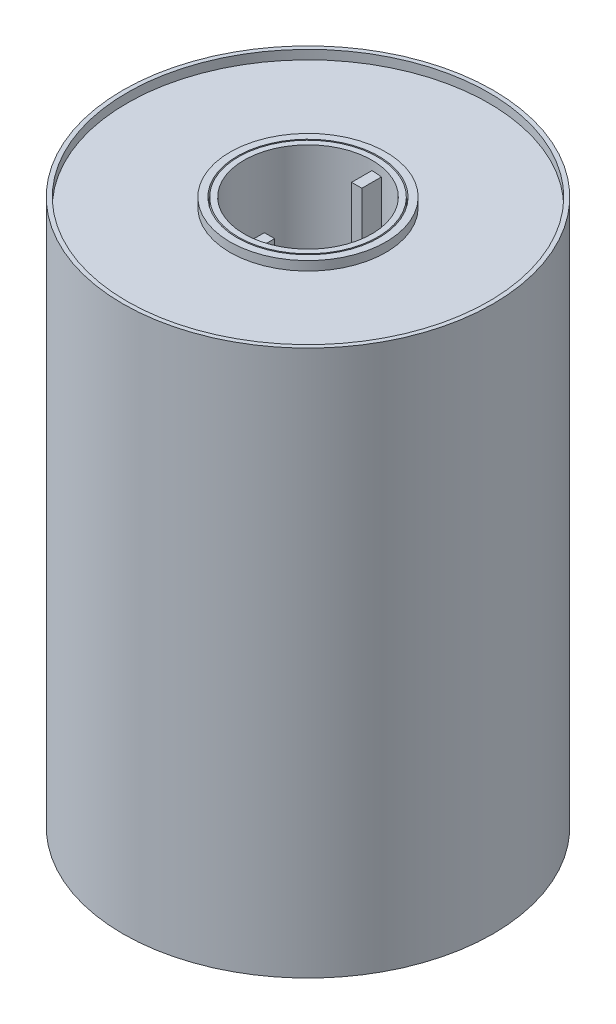
ISO-10303-21;
HEADER;
FILE_DESCRIPTION(('STEP AP214'),'2;1');
FILE_NAME('part.step','',(''),(''),'','','');
FILE_SCHEMA(('AUTOMOTIVE_DESIGN { 1 0 10303 214 1 1 1 1 }'));
ENDSEC;
DATA;
#1=APPLICATION_CONTEXT('core data for automotive mechanical design processes');
#2=APPLICATION_PROTOCOL_DEFINITION('international standard','automotive_design',2000,#1);
#3=PRODUCT_CONTEXT('',#1,'mechanical');
#4=PRODUCT('Part','Part','',(#3));
#5=PRODUCT_RELATED_PRODUCT_CATEGORY('part','',(#4));
#6=PRODUCT_DEFINITION_FORMATION('','',#4);
#7=PRODUCT_DEFINITION_CONTEXT('part definition',#1,'design');
#8=PRODUCT_DEFINITION('design','',#6,#7);
#9=PRODUCT_DEFINITION_SHAPE('','',#8);
#10=(LENGTH_UNIT() NAMED_UNIT(*) SI_UNIT(.MILLI.,.METRE.));
#11=(NAMED_UNIT(*) PLANE_ANGLE_UNIT() SI_UNIT($,.RADIAN.));
#12=(NAMED_UNIT(*) SI_UNIT($,.STERADIAN.) SOLID_ANGLE_UNIT());
#13=UNCERTAINTY_MEASURE_WITH_UNIT(LENGTH_MEASURE(1.E-05),#10,'distance_accuracy_value','');
#14=(GEOMETRIC_REPRESENTATION_CONTEXT(3) GLOBAL_UNCERTAINTY_ASSIGNED_CONTEXT((#13)) GLOBAL_UNIT_ASSIGNED_CONTEXT((#10,
#11,#12)) REPRESENTATION_CONTEXT('',''));
#15=CARTESIAN_POINT('',(0.,0.,0.));
#16=DIRECTION('',(0.,0.,1.));
#17=DIRECTION('',(1.,0.,0.));
#18=AXIS2_PLACEMENT_3D('',#15,#16,#17);
#19=CARTESIAN_POINT('',(0.,147.5,0.));
#20=DIRECTION('',(0.,1.,0.));
#21=DIRECTION('',(0.,0.,1.));
#22=AXIS2_PLACEMENT_3D('',#19,#20,#21);
#23=PLANE('',#22);
#24=CARTESIAN_POINT('',(0.,147.5,0.));
#25=DIRECTION('',(0.,1.,0.));
#26=DIRECTION('',(0.,0.,1.));
#27=AXIS2_PLACEMENT_3D('',#24,#25,#26);
#28=CIRCLE('',#27,19.1218292024238);
#29=CARTESIAN_POINT('',(0.,147.5,19.1218292024238));
#30=VERTEX_POINT('',#29);
#31=EDGE_CURVE('E179',#30,#30,#28,.T.);
#32=ORIENTED_EDGE('',*,*,#31,.F.);
#33=EDGE_LOOP('',(#32));
#34=FACE_BOUND('',#33,.T.);
#35=CARTESIAN_POINT('',(0.,147.5,0.));
#36=DIRECTION('',(0.,1.,0.));
#37=DIRECTION('',(0.,0.,1.));
#38=AXIS2_PLACEMENT_3D('',#35,#36,#37);
#39=CIRCLE('',#38,19.4629871836898);
#40=CARTESIAN_POINT('',(0.,147.5,19.4629871836898));
#41=VERTEX_POINT('',#40);
#42=EDGE_CURVE('E11',#41,#41,#39,.F.);
#43=ORIENTED_EDGE('',*,*,#42,.F.);
#44=EDGE_LOOP('',(#43));
#45=FACE_BOUND('',#44,.T.);
#46=ADVANCED_FACE('F37',(#34,#45),#23,.T.);
#47=CARTESIAN_POINT('',(0.,0.,0.));
#48=DIRECTION('',(0.,1.,0.));
#49=DIRECTION('',(0.,0.,1.));
#50=AXIS2_PLACEMENT_3D('',#47,#48,#49);
#51=CYLINDRICAL_SURFACE('',#50,17.5714106184439);
#52=DIRECTION('',(0.,1.,0.));
#53=VECTOR('',#52,1.);
#54=CARTESIAN_POINT('',(0.,2.5,17.5714106184439));
#55=LINE('',#54,#53);
#56=CARTESIAN_POINT('',(0.,2.5,17.5714106184439));
#57=VERTEX_POINT('',#56);
#58=CARTESIAN_POINT('',(0.,147.5,17.5714106184439));
#59=VERTEX_POINT('',#58);
#60=EDGE_CURVE('E56',#57,#59,#55,.T.);
#61=ORIENTED_EDGE('',*,*,#60,.F.);
#62=CARTESIAN_POINT('',(0.,2.5,0.));
#63=DIRECTION('',(0.,-1.,0.));
#64=DIRECTION('',(0.,0.,-1.));
#65=AXIS2_PLACEMENT_3D('',#62,#63,#64);
#66=CIRCLE('',#65,17.5714106184439);
#67=CARTESIAN_POINT('',(2.81398906962431,2.5,17.344622700941));
#68=VERTEX_POINT('',#67);
#69=EDGE_CURVE('E45',#57,#68,#66,.F.);
#70=ORIENTED_EDGE('',*,*,#69,.T.);
#71=DIRECTION('',(0.,1.,0.));
#72=VECTOR('',#71,1.);
#73=CARTESIAN_POINT('',(2.81398906962431,0.,17.344622700941));
#74=LINE('',#73,#72);
#75=CARTESIAN_POINT('',(2.81398906962431,147.5,17.344622700941));
#76=VERTEX_POINT('',#75);
#77=EDGE_CURVE('E105',#68,#76,#74,.T.);
#78=ORIENTED_EDGE('',*,*,#77,.T.);
#79=CARTESIAN_POINT('',(0.,147.5,0.));
#80=DIRECTION('',(0.,-1.,0.));
#81=DIRECTION('',(0.,0.,-1.));
#82=AXIS2_PLACEMENT_3D('',#79,#80,#81);
#83=CIRCLE('',#82,17.5714106184439);
#84=EDGE_CURVE('E213',#59,#76,#83,.F.);
#85=ORIENTED_EDGE('',*,*,#84,.F.);
#86=EDGE_LOOP('',(#61,#70,#78,#85));
#87=FACE_BOUND('',#86,.T.);
#88=CARTESIAN_POINT('',(0.,150.,0.));
#89=DIRECTION('',(0.,1.,0.));
#90=DIRECTION('',(0.,0.,1.));
#91=AXIS2_PLACEMENT_3D('',#88,#89,#90);
#92=CIRCLE('',#91,17.5714106184439);
#93=CARTESIAN_POINT('',(0.,150.,17.5714106184439));
#94=VERTEX_POINT('',#93);
#95=EDGE_CURVE('E188',#94,#94,#92,.T.);
#96=ORIENTED_EDGE('',*,*,#95,.T.);
#97=EDGE_LOOP('',(#96));
#98=FACE_BOUND('',#97,.T.);
#99=CARTESIAN_POINT('',(0.,0.,0.));
#100=DIRECTION('',(0.,1.,0.));
#101=DIRECTION('',(0.,0.,1.));
#102=AXIS2_PLACEMENT_3D('',#99,#100,#101);
#103=CIRCLE('',#102,17.5714106184439);
#104=CARTESIAN_POINT('',(0.,0.,17.5714106184439));
#105=VERTEX_POINT('',#104);
#106=EDGE_CURVE('E191',#105,#105,#103,.T.);
#107=ORIENTED_EDGE('',*,*,#106,.F.);
#108=EDGE_LOOP('',(#107));
#109=FACE_BOUND('',#108,.T.);
#110=CARTESIAN_POINT('',(0.,2.5,0.));
#111=DIRECTION('',(0.,1.,0.));
#112=DIRECTION('',(0.,0.,1.));
#113=AXIS2_PLACEMENT_3D('',#110,#111,#112);
#114=CIRCLE('',#113,17.5714106184439);
#115=CARTESIAN_POINT('',(0.,2.5,-17.5714106184439));
#116=VERTEX_POINT('',#115);
#117=CARTESIAN_POINT('',(2.81398906962431,2.5,-17.344622700941));
#118=VERTEX_POINT('',#117);
#119=EDGE_CURVE('E211',#116,#118,#114,.F.);
#120=ORIENTED_EDGE('',*,*,#119,.F.);
#121=DIRECTION('',(0.,1.,0.));
#122=VECTOR('',#121,1.);
#123=CARTESIAN_POINT('',(0.,2.5,-17.5714106184439));
#124=LINE('',#123,#122);
#125=CARTESIAN_POINT('',(0.,147.5,-17.5714106184439));
#126=VERTEX_POINT('',#125);
#127=EDGE_CURVE('E151',#116,#126,#124,.T.);
#128=ORIENTED_EDGE('',*,*,#127,.T.);
#129=CARTESIAN_POINT('',(0.,147.5,0.));
#130=DIRECTION('',(0.,1.,0.));
#131=DIRECTION('',(0.,0.,1.));
#132=AXIS2_PLACEMENT_3D('',#129,#130,#131);
#133=CIRCLE('',#132,17.5714106184439);
#134=CARTESIAN_POINT('',(2.81398906962431,147.5,-17.344622700941));
#135=VERTEX_POINT('',#134);
#136=EDGE_CURVE('E205',#126,#135,#133,.F.);
#137=ORIENTED_EDGE('',*,*,#136,.T.);
#138=DIRECTION('',(0.,1.,0.));
#139=VECTOR('',#138,1.);
#140=CARTESIAN_POINT('',(2.81398906962431,0.,-17.344622700941));
#141=LINE('',#140,#139);
#142=EDGE_CURVE('E208',#135,#118,#141,.F.);
#143=ORIENTED_EDGE('',*,*,#142,.T.);
#144=EDGE_LOOP('',(#120,#128,#137,#143));
#145=FACE_BOUND('',#144,.T.);
#146=ADVANCED_FACE('F216',(#87,#98,#109,#145),#51,.F.);
#147=CARTESIAN_POINT('',(0.,0.,0.));
#148=DIRECTION('',(0.,1.,0.));
#149=DIRECTION('',(0.,0.,1.));
#150=AXIS2_PLACEMENT_3D('',#147,#148,#149);
#151=PLANE('',#150);
#152=CARTESIAN_POINT('',(0.,0.,0.));
#153=DIRECTION('',(0.,1.,0.));
#154=DIRECTION('',(0.,0.,1.));
#155=AXIS2_PLACEMENT_3D('',#152,#153,#154);
#156=CIRCLE('',#155,19.4768924120961);
#157=CARTESIAN_POINT('',(0.,0.,19.4768924120961));
#158=VERTEX_POINT('',#157);
#159=EDGE_CURVE('E200',#158,#158,#156,.F.);
#160=ORIENTED_EDGE('',*,*,#159,.F.);
#161=EDGE_LOOP('',(#160));
#162=FACE_BOUND('',#161,.T.);
#163=CARTESIAN_POINT('',(0.,0.,0.));
#164=DIRECTION('',(0.,-1.,0.));
#165=DIRECTION('',(0.,0.,-1.));
#166=AXIS2_PLACEMENT_3D('',#163,#164,#165);
#167=CIRCLE('',#166,21.5317394756691);
#168=CARTESIAN_POINT('',(0.,0.,-21.5317394756691));
#169=VERTEX_POINT('',#168);
#170=EDGE_CURVE('E154',#169,#169,#167,.T.);
#171=ORIENTED_EDGE('',*,*,#170,.T.);
#172=EDGE_LOOP('',(#171));
#173=FACE_BOUND('',#172,.T.);
#174=ADVANCED_FACE('F256',(#162,#173),#151,.F.);
#175=ORIENTED_EDGE('',*,*,#106,.T.);
#176=EDGE_LOOP('',(#175));
#177=FACE_BOUND('',#176,.T.);
#178=CARTESIAN_POINT('',(0.,0.,0.));
#179=DIRECTION('',(0.,-1.,0.));
#180=DIRECTION('',(0.,0.,-1.));
#181=AXIS2_PLACEMENT_3D('',#178,#179,#180);
#182=CIRCLE('',#181,17.829813715774);
#183=CARTESIAN_POINT('',(0.,0.,-17.829813715774));
#184=VERTEX_POINT('',#183);
#185=EDGE_CURVE('E167',#184,#184,#182,.T.);
#186=ORIENTED_EDGE('',*,*,#185,.T.);
#187=EDGE_LOOP('',(#186));
#188=FACE_BOUND('',#187,.T.);
#189=ADVANCED_FACE('F293',(#177,#188),#151,.F.);
#190=CARTESIAN_POINT('',(0.,150.,0.));
#191=DIRECTION('',(0.,1.,0.));
#192=DIRECTION('',(0.,0.,1.));
#193=AXIS2_PLACEMENT_3D('',#190,#191,#192);
#194=PLANE('',#193);
#195=ORIENTED_EDGE('',*,*,#95,.F.);
#196=EDGE_LOOP('',(#195));
#197=FACE_BOUND('',#196,.T.);
#198=CARTESIAN_POINT('',(0.,150.,0.));
#199=DIRECTION('',(0.,1.,0.));
#200=DIRECTION('',(0.,0.,1.));
#201=AXIS2_PLACEMENT_3D('',#198,#199,#200);
#202=CIRCLE('',#201,19.1218292024238);
#203=CARTESIAN_POINT('',(0.,150.,19.1218292024238));
#204=VERTEX_POINT('',#203);
#205=EDGE_CURVE('E178',#204,#204,#202,.T.);
#206=ORIENTED_EDGE('',*,*,#205,.T.);
#207=EDGE_LOOP('',(#206));
#208=FACE_BOUND('',#207,.T.);
#209=ADVANCED_FACE('F284',(#197,#208),#194,.T.);
#210=CARTESIAN_POINT('',(0.,150.,0.));
#211=DIRECTION('',(0.,-1.,0.));
#212=DIRECTION('',(0.,0.,-1.));
#213=AXIS2_PLACEMENT_3D('',#210,#211,#212);
#214=CYLINDRICAL_SURFACE('',#213,50.8900947095449);
#215=CARTESIAN_POINT('',(0.,150.,0.));
#216=DIRECTION('',(0.,1.,0.));
#217=DIRECTION('',(0.,0.,1.));
#218=AXIS2_PLACEMENT_3D('',#215,#216,#217);
#219=CIRCLE('',#218,50.8900947095449);
#220=CARTESIAN_POINT('',(0.,150.,50.8900947095449));
#221=VERTEX_POINT('',#220);
#222=EDGE_CURVE('E197',#221,#221,#219,.T.);
#223=ORIENTED_EDGE('',*,*,#222,.F.);
#224=EDGE_LOOP('',(#223));
#225=FACE_BOUND('',#224,.T.);
#226=CARTESIAN_POINT('',(0.,0.,0.));
#227=DIRECTION('',(0.,1.,0.));
#228=DIRECTION('',(0.,0.,1.));
#229=AXIS2_PLACEMENT_3D('',#226,#227,#228);
#230=CIRCLE('',#229,50.8900947095449);
#231=CARTESIAN_POINT('',(0.,0.,50.8900947095449));
#232=VERTEX_POINT('',#231);
#233=EDGE_CURVE('E194',#232,#232,#230,.T.);
#234=ORIENTED_EDGE('',*,*,#233,.T.);
#235=EDGE_LOOP('',(#234));
#236=FACE_BOUND('',#235,.T.);
#237=ADVANCED_FACE('F39',(#225,#236),#214,.T.);
#238=CARTESIAN_POINT('',(0.,150.,0.));
#239=DIRECTION('',(0.,1.,0.));
#240=DIRECTION('',(0.,0.,1.));
#241=AXIS2_PLACEMENT_3D('',#238,#239,#240);
#242=CIRCLE('',#241,49.7184279972298);
#243=CARTESIAN_POINT('',(0.,150.,49.7184279972298));
#244=VERTEX_POINT('',#243);
#245=EDGE_CURVE('E182',#244,#244,#242,.T.);
#246=ORIENTED_EDGE('',*,*,#245,.F.);
#247=EDGE_LOOP('',(#246));
#248=FACE_BOUND('',#247,.T.);
#249=ORIENTED_EDGE('',*,*,#222,.T.);
#250=EDGE_LOOP('',(#249));
#251=FACE_BOUND('',#250,.T.);
#252=ADVANCED_FACE('F280',(#248,#251),#194,.T.);
#253=CARTESIAN_POINT('',(0.,0.,0.));
#254=DIRECTION('',(0.,-1.,0.));
#255=DIRECTION('',(0.,0.,-1.));
#256=AXIS2_PLACEMENT_3D('',#253,#254,#255);
#257=CIRCLE('',#256,49.233249933002);
#258=CARTESIAN_POINT('',(0.,0.,-49.233249933002));
#259=VERTEX_POINT('',#258);
#260=EDGE_CURVE('E161',#259,#259,#257,.T.);
#261=ORIENTED_EDGE('',*,*,#260,.F.);
#262=EDGE_LOOP('',(#261));
#263=FACE_BOUND('',#262,.T.);
#264=ORIENTED_EDGE('',*,*,#233,.F.);
#265=EDGE_LOOP('',(#264));
#266=FACE_BOUND('',#265,.T.);
#267=ADVANCED_FACE('F272',(#263,#266),#151,.F.);
#268=CARTESIAN_POINT('',(0.,147.5,0.));
#269=DIRECTION('',(0.,1.,0.));
#270=DIRECTION('',(0.,0.,1.));
#271=AXIS2_PLACEMENT_3D('',#268,#269,#270);
#272=CYLINDRICAL_SURFACE('',#271,49.7184279972298);
#273=CARTESIAN_POINT('',(0.,147.5,0.));
#274=DIRECTION('',(0.,1.,0.));
#275=DIRECTION('',(0.,0.,1.));
#276=AXIS2_PLACEMENT_3D('',#273,#274,#275);
#277=CIRCLE('',#276,49.7184279972298);
#278=CARTESIAN_POINT('',(0.,147.5,49.7184279972298));
#279=VERTEX_POINT('',#278);
#280=EDGE_CURVE('E185',#279,#279,#277,.T.);
#281=ORIENTED_EDGE('',*,*,#280,.F.);
#282=EDGE_LOOP('',(#281));
#283=FACE_BOUND('',#282,.T.);
#284=ORIENTED_EDGE('',*,*,#245,.T.);
#285=EDGE_LOOP('',(#284));
#286=FACE_BOUND('',#285,.T.);
#287=ADVANCED_FACE('F264',(#283,#286),#272,.F.);
#288=CARTESIAN_POINT('',(0.,147.5,0.));
#289=DIRECTION('',(0.,1.,0.));
#290=DIRECTION('',(0.,0.,1.));
#291=AXIS2_PLACEMENT_3D('',#288,#289,#290);
#292=CIRCLE('',#291,21.4211400149472);
#293=CARTESIAN_POINT('',(0.,147.5,21.4211400149472));
#294=VERTEX_POINT('',#293);
#295=EDGE_CURVE('E224',#294,#294,#292,.T.);
#296=ORIENTED_EDGE('',*,*,#295,.F.);
#297=EDGE_LOOP('',(#296));
#298=FACE_BOUND('',#297,.T.);
#299=ORIENTED_EDGE('',*,*,#280,.T.);
#300=EDGE_LOOP('',(#299));
#301=FACE_BOUND('',#300,.T.);
#302=ADVANCED_FACE('F252',(#298,#301),#23,.T.);
#303=CARTESIAN_POINT('',(0.,147.5,0.));
#304=DIRECTION('',(0.,1.,0.));
#305=DIRECTION('',(0.,0.,1.));
#306=AXIS2_PLACEMENT_3D('',#303,#304,#305);
#307=CYLINDRICAL_SURFACE('',#306,19.1218292024238);
#308=ORIENTED_EDGE('',*,*,#31,.T.);
#309=EDGE_LOOP('',(#308));
#310=FACE_BOUND('',#309,.T.);
#311=ORIENTED_EDGE('',*,*,#205,.F.);
#312=EDGE_LOOP('',(#311));
#313=FACE_BOUND('',#312,.T.);
#314=ADVANCED_FACE('F263',(#310,#313),#307,.T.);
#315=CARTESIAN_POINT('',(0.,-15.,0.));
#316=DIRECTION('',(0.,-1.,0.));
#317=DIRECTION('',(0.,0.,-1.));
#318=AXIS2_PLACEMENT_3D('',#315,#316,#317);
#319=PLANE('',#318);
#320=CARTESIAN_POINT('',(0.,-15.,0.));
#321=DIRECTION('',(0.,-1.,0.));
#322=DIRECTION('',(0.,0.,-1.));
#323=AXIS2_PLACEMENT_3D('',#320,#321,#322);
#324=CIRCLE('',#323,19.4768924120961);
#325=CARTESIAN_POINT('',(0.,-15.,-19.4768924120961));
#326=VERTEX_POINT('',#325);
#327=EDGE_CURVE('E173',#326,#326,#324,.T.);
#328=ORIENTED_EDGE('',*,*,#327,.T.);
#329=EDGE_LOOP('',(#328));
#330=FACE_BOUND('',#329,.T.);
#331=CARTESIAN_POINT('',(0.,-15.,0.));
#332=DIRECTION('',(0.,-1.,0.));
#333=DIRECTION('',(0.,0.,-1.));
#334=AXIS2_PLACEMENT_3D('',#331,#332,#333);
#335=CIRCLE('',#334,17.829813715774);
#336=CARTESIAN_POINT('',(0.,-15.,-17.829813715774));
#337=VERTEX_POINT('',#336);
#338=EDGE_CURVE('E170',#337,#337,#335,.T.);
#339=ORIENTED_EDGE('',*,*,#338,.F.);
#340=EDGE_LOOP('',(#339));
#341=FACE_BOUND('',#340,.T.);
#342=ADVANCED_FACE('F270',(#330,#341),#319,.T.);
#343=CARTESIAN_POINT('',(0.,-15.,0.));
#344=DIRECTION('',(0.,1.,0.));
#345=DIRECTION('',(0.,0.,1.));
#346=AXIS2_PLACEMENT_3D('',#343,#344,#345);
#347=CYLINDRICAL_SURFACE('',#346,19.4768924120961);
#348=ORIENTED_EDGE('',*,*,#327,.F.);
#349=EDGE_LOOP('',(#348));
#350=FACE_BOUND('',#349,.T.);
#351=ORIENTED_EDGE('',*,*,#159,.T.);
#352=EDGE_LOOP('',(#351));
#353=FACE_BOUND('',#352,.T.);
#354=ADVANCED_FACE('F312',(#350,#353),#347,.T.);
#355=CARTESIAN_POINT('',(0.,-15.,0.));
#356=DIRECTION('',(0.,1.,0.));
#357=DIRECTION('',(0.,0.,1.));
#358=AXIS2_PLACEMENT_3D('',#355,#356,#357);
#359=CYLINDRICAL_SURFACE('',#358,17.829813715774);
#360=ORIENTED_EDGE('',*,*,#338,.T.);
#361=EDGE_LOOP('',(#360));
#362=FACE_BOUND('',#361,.T.);
#363=ORIENTED_EDGE('',*,*,#185,.F.);
#364=EDGE_LOOP('',(#363));
#365=FACE_BOUND('',#364,.T.);
#366=ADVANCED_FACE('F309',(#362,#365),#359,.F.);
#367=CARTESIAN_POINT('',(0.,5.,0.));
#368=DIRECTION('',(0.,-1.,0.));
#369=DIRECTION('',(0.,0.,-1.));
#370=AXIS2_PLACEMENT_3D('',#367,#368,#369);
#371=CYLINDRICAL_SURFACE('',#370,49.233249933002);
#372=CARTESIAN_POINT('',(0.,5.,0.));
#373=DIRECTION('',(0.,-1.,0.));
#374=DIRECTION('',(0.,0.,-1.));
#375=AXIS2_PLACEMENT_3D('',#372,#373,#374);
#376=CIRCLE('',#375,49.233249933002);
#377=CARTESIAN_POINT('',(0.,5.,-49.233249933002));
#378=VERTEX_POINT('',#377);
#379=EDGE_CURVE('E164',#378,#378,#376,.T.);
#380=ORIENTED_EDGE('',*,*,#379,.F.);
#381=EDGE_LOOP('',(#380));
#382=FACE_BOUND('',#381,.T.);
#383=ORIENTED_EDGE('',*,*,#260,.T.);
#384=EDGE_LOOP('',(#383));
#385=FACE_BOUND('',#384,.T.);
#386=ADVANCED_FACE('F311',(#382,#385),#371,.F.);
#387=CARTESIAN_POINT('',(0.,5.,0.));
#388=DIRECTION('',(0.,-1.,0.));
#389=DIRECTION('',(0.,0.,-1.));
#390=AXIS2_PLACEMENT_3D('',#387,#388,#389);
#391=PLANE('',#390);
#392=CARTESIAN_POINT('',(0.,5.,0.));
#393=DIRECTION('',(0.,-1.,0.));
#394=DIRECTION('',(0.,0.,-1.));
#395=AXIS2_PLACEMENT_3D('',#392,#393,#394);
#396=CIRCLE('',#395,21.5317394756691);
#397=CARTESIAN_POINT('',(0.,5.,-21.5317394756691));
#398=VERTEX_POINT('',#397);
#399=EDGE_CURVE('E158',#398,#398,#396,.T.);
#400=ORIENTED_EDGE('',*,*,#399,.F.);
#401=EDGE_LOOP('',(#400));
#402=FACE_BOUND('',#401,.T.);
#403=ORIENTED_EDGE('',*,*,#379,.T.);
#404=EDGE_LOOP('',(#403));
#405=FACE_BOUND('',#404,.T.);
#406=ADVANCED_FACE('F319',(#402,#405),#391,.T.);
#407=CARTESIAN_POINT('',(0.,5.,0.));
#408=DIRECTION('',(0.,-1.,0.));
#409=DIRECTION('',(0.,0.,-1.));
#410=AXIS2_PLACEMENT_3D('',#407,#408,#409);
#411=CYLINDRICAL_SURFACE('',#410,21.5317394756691);
#412=ORIENTED_EDGE('',*,*,#399,.T.);
#413=EDGE_LOOP('',(#412));
#414=FACE_BOUND('',#413,.T.);
#415=ORIENTED_EDGE('',*,*,#170,.F.);
#416=EDGE_LOOP('',(#415));
#417=FACE_BOUND('',#416,.T.);
#418=ADVANCED_FACE('F338',(#414,#417),#411,.T.);
#419=CARTESIAN_POINT('',(2.81398906962431,2.5,-17.5714106184439));
#420=DIRECTION('',(1.,0.,0.));
#421=DIRECTION('',(0.,0.,-1.));
#422=AXIS2_PLACEMENT_3D('',#419,#420,#421);
#423=PLANE('',#422);
#424=ORIENTED_EDGE('',*,*,#142,.F.);
#425=DIRECTION('',(0.,0.,-1.));
#426=VECTOR('',#425,1.);
#427=CARTESIAN_POINT('',(2.81398906962431,147.5,-17.5714106184439));
#428=LINE('',#427,#426);
#429=CARTESIAN_POINT('',(2.81398906962431,147.5,-11.9952929361759));
#430=VERTEX_POINT('',#429);
#431=EDGE_CURVE('E138',#430,#135,#428,.T.);
#432=ORIENTED_EDGE('',*,*,#431,.F.);
#433=DIRECTION('',(0.,1.,0.));
#434=VECTOR('',#433,1.);
#435=CARTESIAN_POINT('',(2.81398906962431,2.5,-11.9952929361759));
#436=LINE('',#435,#434);
#437=CARTESIAN_POINT('',(2.81398906962431,2.5,-11.9952929361759));
#438=VERTEX_POINT('',#437);
#439=EDGE_CURVE('E155',#438,#430,#436,.T.);
#440=ORIENTED_EDGE('',*,*,#439,.F.);
#441=DIRECTION('',(0.,0.,-1.));
#442=VECTOR('',#441,1.);
#443=CARTESIAN_POINT('',(2.81398906962431,2.5,-17.5714106184439));
#444=LINE('',#443,#442);
#445=EDGE_CURVE('E141',#438,#118,#444,.T.);
#446=ORIENTED_EDGE('',*,*,#445,.T.);
#447=EDGE_LOOP('',(#424,#432,#440,#446));
#448=FACE_BOUND('',#447,.T.);
#449=ADVANCED_FACE('F340',(#448),#423,.T.);
#450=CARTESIAN_POINT('',(0.,2.5,0.));
#451=DIRECTION('',(0.,1.,0.));
#452=DIRECTION('',(0.,0.,1.));
#453=AXIS2_PLACEMENT_3D('',#450,#451,#452);
#454=PLANE('',#453);
#455=DIRECTION('',(0.,0.,1.));
#456=VECTOR('',#455,1.);
#457=CARTESIAN_POINT('',(0.,2.5,-17.5714106184439));
#458=LINE('',#457,#456);
#459=CARTESIAN_POINT('',(0.,2.5,-11.9952929361759));
#460=VERTEX_POINT('',#459);
#461=EDGE_CURVE('E134',#116,#460,#458,.T.);
#462=ORIENTED_EDGE('',*,*,#461,.F.);
#463=ORIENTED_EDGE('',*,*,#119,.T.);
#464=ORIENTED_EDGE('',*,*,#445,.F.);
#465=DIRECTION('',(1.,0.,0.));
#466=VECTOR('',#465,1.);
#467=CARTESIAN_POINT('',(0.,2.5,-11.9952929361759));
#468=LINE('',#467,#466);
#469=EDGE_CURVE('E137',#460,#438,#468,.T.);
#470=ORIENTED_EDGE('',*,*,#469,.F.);
#471=EDGE_LOOP('',(#462,#463,#464,#470));
#472=FACE_BOUND('',#471,.T.);
#473=ADVANCED_FACE('F347',(#472),#454,.F.);
#474=CARTESIAN_POINT('',(0.,147.5,0.));
#475=DIRECTION('',(0.,1.,0.));
#476=DIRECTION('',(0.,0.,1.));
#477=AXIS2_PLACEMENT_3D('',#474,#475,#476);
#478=PLANE('',#477);
#479=ORIENTED_EDGE('',*,*,#136,.F.);
#480=DIRECTION('',(0.,0.,1.));
#481=VECTOR('',#480,1.);
#482=CARTESIAN_POINT('',(0.,147.5,-17.5714106184439));
#483=LINE('',#482,#481);
#484=CARTESIAN_POINT('',(0.,147.5,-11.9952929361759));
#485=VERTEX_POINT('',#484);
#486=EDGE_CURVE('E132',#126,#485,#483,.T.);
#487=ORIENTED_EDGE('',*,*,#486,.T.);
#488=DIRECTION('',(1.,0.,0.));
#489=VECTOR('',#488,1.);
#490=CARTESIAN_POINT('',(0.,147.5,-11.9952929361759));
#491=LINE('',#490,#489);
#492=EDGE_CURVE('E147',#485,#430,#491,.T.);
#493=ORIENTED_EDGE('',*,*,#492,.T.);
#494=ORIENTED_EDGE('',*,*,#431,.T.);
#495=EDGE_LOOP('',(#479,#487,#493,#494));
#496=FACE_BOUND('',#495,.T.);
#497=ADVANCED_FACE('F356',(#496),#478,.T.);
#498=CARTESIAN_POINT('',(0.,2.5,-17.5714106184439));
#499=DIRECTION('',(-1.,0.,0.));
#500=DIRECTION('',(0.,0.,1.));
#501=AXIS2_PLACEMENT_3D('',#498,#499,#500);
#502=PLANE('',#501);
#503=ORIENTED_EDGE('',*,*,#486,.F.);
#504=ORIENTED_EDGE('',*,*,#127,.F.);
#505=ORIENTED_EDGE('',*,*,#461,.T.);
#506=DIRECTION('',(0.,1.,0.));
#507=VECTOR('',#506,1.);
#508=CARTESIAN_POINT('',(0.,2.5,-11.9952929361759));
#509=LINE('',#508,#507);
#510=EDGE_CURVE('E144',#460,#485,#509,.T.);
#511=ORIENTED_EDGE('',*,*,#510,.T.);
#512=EDGE_LOOP('',(#503,#504,#505,#511));
#513=FACE_BOUND('',#512,.T.);
#514=ADVANCED_FACE('F352',(#513),#502,.T.);
#515=CARTESIAN_POINT('',(0.,2.5,-11.9952929361759));
#516=DIRECTION('',(0.,0.,1.));
#517=DIRECTION('',(1.,0.,0.));
#518=AXIS2_PLACEMENT_3D('',#515,#516,#517);
#519=PLANE('',#518);
#520=ORIENTED_EDGE('',*,*,#492,.F.);
#521=ORIENTED_EDGE('',*,*,#510,.F.);
#522=ORIENTED_EDGE('',*,*,#469,.T.);
#523=ORIENTED_EDGE('',*,*,#439,.T.);
#524=EDGE_LOOP('',(#520,#521,#522,#523));
#525=FACE_BOUND('',#524,.T.);
#526=ADVANCED_FACE('F355',(#525),#519,.T.);
#527=CARTESIAN_POINT('',(2.81398906962431,2.5,17.5714106184439));
#528=DIRECTION('',(1.,0.,0.));
#529=DIRECTION('',(0.,0.,-1.));
#530=AXIS2_PLACEMENT_3D('',#527,#528,#529);
#531=PLANE('',#530);
#532=ORIENTED_EDGE('',*,*,#77,.F.);
#533=DIRECTION('',(0.,0.,-1.));
#534=VECTOR('',#533,1.);
#535=CARTESIAN_POINT('',(2.81398906962431,2.5,17.5714106184439));
#536=LINE('',#535,#534);
#537=CARTESIAN_POINT('',(2.81398906962431,2.5,11.9952929361759));
#538=VERTEX_POINT('',#537);
#539=EDGE_CURVE('E99',#68,#538,#536,.T.);
#540=ORIENTED_EDGE('',*,*,#539,.T.);
#541=DIRECTION('',(0.,1.,0.));
#542=VECTOR('',#541,1.);
#543=CARTESIAN_POINT('',(2.81398906962431,2.5,11.9952929361759));
#544=LINE('',#543,#542);
#545=CARTESIAN_POINT('',(2.81398906962431,147.5,11.9952929361759));
#546=VERTEX_POINT('',#545);
#547=EDGE_CURVE('E103',#538,#546,#544,.T.);
#548=ORIENTED_EDGE('',*,*,#547,.T.);
#549=DIRECTION('',(0.,0.,-1.));
#550=VECTOR('',#549,1.);
#551=CARTESIAN_POINT('',(2.81398906962431,147.5,17.5714106184439));
#552=LINE('',#551,#550);
#553=EDGE_CURVE('E128',#76,#546,#552,.T.);
#554=ORIENTED_EDGE('',*,*,#553,.F.);
#555=EDGE_LOOP('',(#532,#540,#548,#554));
#556=FACE_BOUND('',#555,.T.);
#557=ADVANCED_FACE('F101',(#556),#531,.T.);
#558=CARTESIAN_POINT('',(0.,2.5,0.));
#559=DIRECTION('',(0.,-1.,0.));
#560=DIRECTION('',(0.,0.,-1.));
#561=AXIS2_PLACEMENT_3D('',#558,#559,#560);
#562=PLANE('',#561);
#563=ORIENTED_EDGE('',*,*,#69,.F.);
#564=DIRECTION('',(0.,0.,1.));
#565=VECTOR('',#564,1.);
#566=CARTESIAN_POINT('',(0.,2.5,17.5714106184439));
#567=LINE('',#566,#565);
#568=CARTESIAN_POINT('',(0.,2.5,11.9952929361759));
#569=VERTEX_POINT('',#568);
#570=EDGE_CURVE('E109',#569,#57,#567,.T.);
#571=ORIENTED_EDGE('',*,*,#570,.F.);
#572=DIRECTION('',(-1.,0.,0.));
#573=VECTOR('',#572,1.);
#574=CARTESIAN_POINT('',(0.,2.5,11.9952929361759));
#575=LINE('',#574,#573);
#576=EDGE_CURVE('E108',#538,#569,#575,.T.);
#577=ORIENTED_EDGE('',*,*,#576,.F.);
#578=ORIENTED_EDGE('',*,*,#539,.F.);
#579=EDGE_LOOP('',(#563,#571,#577,#578));
#580=FACE_BOUND('',#579,.T.);
#581=ADVANCED_FACE('F119',(#580),#562,.T.);
#582=CARTESIAN_POINT('',(0.,147.5,0.));
#583=DIRECTION('',(0.,-1.,0.));
#584=DIRECTION('',(0.,0.,-1.));
#585=AXIS2_PLACEMENT_3D('',#582,#583,#584);
#586=PLANE('',#585);
#587=DIRECTION('',(0.,0.,1.));
#588=VECTOR('',#587,1.);
#589=CARTESIAN_POINT('',(0.,147.5,17.5714106184439));
#590=LINE('',#589,#588);
#591=CARTESIAN_POINT('',(0.,147.5,11.9952929361759));
#592=VERTEX_POINT('',#591);
#593=EDGE_CURVE('E125',#592,#59,#590,.T.);
#594=ORIENTED_EDGE('',*,*,#593,.T.);
#595=ORIENTED_EDGE('',*,*,#84,.T.);
#596=ORIENTED_EDGE('',*,*,#553,.T.);
#597=DIRECTION('',(-1.,0.,0.));
#598=VECTOR('',#597,1.);
#599=CARTESIAN_POINT('',(0.,147.5,11.9952929361759));
#600=LINE('',#599,#598);
#601=EDGE_CURVE('E115',#546,#592,#600,.T.);
#602=ORIENTED_EDGE('',*,*,#601,.T.);
#603=EDGE_LOOP('',(#594,#595,#596,#602));
#604=FACE_BOUND('',#603,.T.);
#605=ADVANCED_FACE('F219',(#604),#586,.F.);
#606=CARTESIAN_POINT('',(0.,2.5,17.5714106184439));
#607=DIRECTION('',(-1.,0.,0.));
#608=DIRECTION('',(0.,0.,1.));
#609=AXIS2_PLACEMENT_3D('',#606,#607,#608);
#610=PLANE('',#609);
#611=ORIENTED_EDGE('',*,*,#593,.F.);
#612=DIRECTION('',(0.,1.,0.));
#613=VECTOR('',#612,1.);
#614=CARTESIAN_POINT('',(0.,2.5,11.9952929361759));
#615=LINE('',#614,#613);
#616=EDGE_CURVE('E116',#569,#592,#615,.T.);
#617=ORIENTED_EDGE('',*,*,#616,.F.);
#618=ORIENTED_EDGE('',*,*,#570,.T.);
#619=ORIENTED_EDGE('',*,*,#60,.T.);
#620=EDGE_LOOP('',(#611,#617,#618,#619));
#621=FACE_BOUND('',#620,.T.);
#622=ADVANCED_FACE('F222',(#621),#610,.T.);
#623=CARTESIAN_POINT('',(0.,2.5,11.9952929361759));
#624=DIRECTION('',(0.,0.,-1.));
#625=DIRECTION('',(-1.,0.,0.));
#626=AXIS2_PLACEMENT_3D('',#623,#624,#625);
#627=PLANE('',#626);
#628=ORIENTED_EDGE('',*,*,#601,.F.);
#629=ORIENTED_EDGE('',*,*,#547,.F.);
#630=ORIENTED_EDGE('',*,*,#576,.T.);
#631=ORIENTED_EDGE('',*,*,#616,.T.);
#632=EDGE_LOOP('',(#628,#629,#630,#631));
#633=FACE_BOUND('',#632,.T.);
#634=ADVANCED_FACE('F113',(#633),#627,.T.);
#635=CARTESIAN_POINT('',(0.,150.,0.));
#636=DIRECTION('',(0.,1.,0.));
#637=DIRECTION('',(0.,0.,1.));
#638=AXIS2_PLACEMENT_3D('',#635,#636,#637);
#639=PLANE('',#638);
#640=CARTESIAN_POINT('',(0.,150.,0.));
#641=DIRECTION('',(0.,1.,0.));
#642=DIRECTION('',(0.,0.,1.));
#643=AXIS2_PLACEMENT_3D('',#640,#641,#642);
#644=CIRCLE('',#643,21.4211400149472);
#645=CARTESIAN_POINT('',(0.,150.,21.4211400149472));
#646=VERTEX_POINT('',#645);
#647=EDGE_CURVE('E129',#646,#646,#644,.T.);
#648=ORIENTED_EDGE('',*,*,#647,.T.);
#649=EDGE_LOOP('',(#648));
#650=FACE_BOUND('',#649,.T.);
#651=CARTESIAN_POINT('',(0.,150.,0.));
#652=DIRECTION('',(0.,1.,0.));
#653=DIRECTION('',(0.,0.,1.));
#654=AXIS2_PLACEMENT_3D('',#651,#652,#653);
#655=CIRCLE('',#654,19.4629871836898);
#656=CARTESIAN_POINT('',(0.,150.,19.4629871836898));
#657=VERTEX_POINT('',#656);
#658=EDGE_CURVE('E227',#657,#657,#655,.T.);
#659=ORIENTED_EDGE('',*,*,#658,.F.);
#660=EDGE_LOOP('',(#659));
#661=FACE_BOUND('',#660,.T.);
#662=ADVANCED_FACE('F236',(#650,#661),#639,.T.);
#663=CARTESIAN_POINT('',(0.,150.,0.));
#664=DIRECTION('',(0.,-1.,0.));
#665=DIRECTION('',(0.,0.,-1.));
#666=AXIS2_PLACEMENT_3D('',#663,#664,#665);
#667=CYLINDRICAL_SURFACE('',#666,21.4211400149472);
#668=ORIENTED_EDGE('',*,*,#647,.F.);
#669=EDGE_LOOP('',(#668));
#670=FACE_BOUND('',#669,.T.);
#671=ORIENTED_EDGE('',*,*,#295,.T.);
#672=EDGE_LOOP('',(#671));
#673=FACE_BOUND('',#672,.T.);
#674=ADVANCED_FACE('F238',(#670,#673),#667,.T.);
#675=CARTESIAN_POINT('',(0.,150.,0.));
#676=DIRECTION('',(0.,-1.,0.));
#677=DIRECTION('',(0.,0.,-1.));
#678=AXIS2_PLACEMENT_3D('',#675,#676,#677);
#679=CYLINDRICAL_SURFACE('',#678,19.4629871836898);
#680=ORIENTED_EDGE('',*,*,#658,.T.);
#681=EDGE_LOOP('',(#680));
#682=FACE_BOUND('',#681,.T.);
#683=ORIENTED_EDGE('',*,*,#42,.T.);
#684=EDGE_LOOP('',(#683));
#685=FACE_BOUND('',#684,.T.);
#686=ADVANCED_FACE('F233',(#682,#685),#679,.F.);
#687=CLOSED_SHELL('',(#46,#146,#174,#189,#209,#237,#252,#267,#287,#302,#314,#342,#354,#366,#386,
#406,#418,#449,#473,#497,#514,#526,#557,#581,#605,#622,#634,#662,#674,#686));
#688=MANIFOLD_SOLID_BREP('B2',#687);
#689=ADVANCED_BREP_SHAPE_REPRESENTATION('',(#18,#688),#14);
#690=SHAPE_DEFINITION_REPRESENTATION(#9,#689);
ENDSEC;
END-ISO-10303-21;
